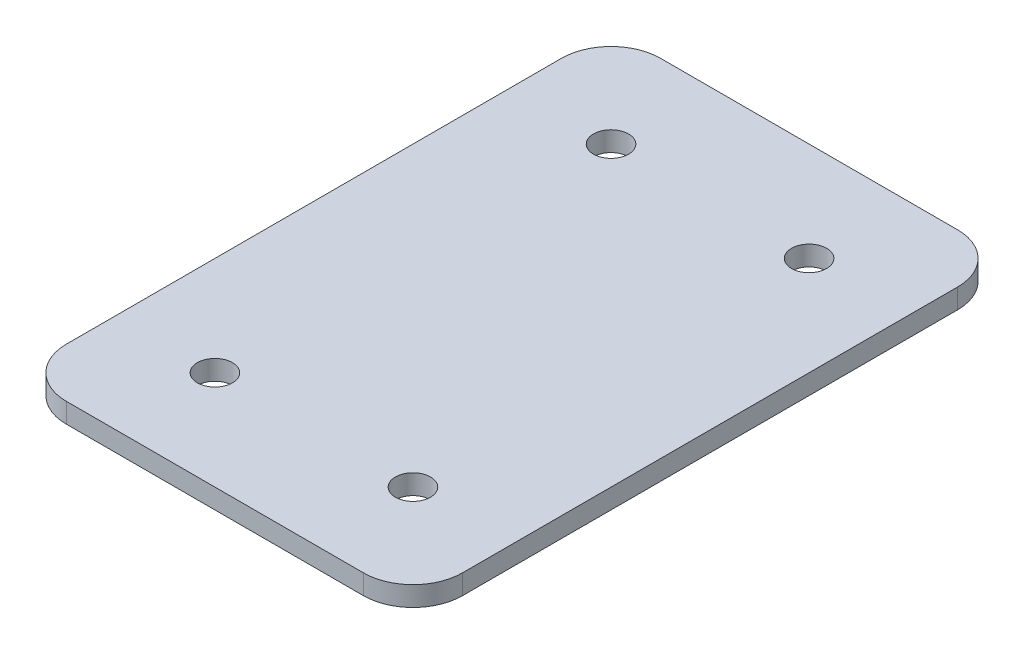
ISO-10303-21;
HEADER;
FILE_DESCRIPTION(('STEP AP214'),'2;1');
FILE_NAME('part.step','',(''),(''),'','','');
FILE_SCHEMA(('AUTOMOTIVE_DESIGN { 1 0 10303 214 1 1 1 1 }'));
ENDSEC;
DATA;
#1=APPLICATION_CONTEXT('core data for automotive mechanical design processes');
#2=APPLICATION_PROTOCOL_DEFINITION('international standard','automotive_design',2000,#1);
#3=PRODUCT_CONTEXT('',#1,'mechanical');
#4=PRODUCT('Part','Part','',(#3));
#5=PRODUCT_RELATED_PRODUCT_CATEGORY('part','',(#4));
#6=PRODUCT_DEFINITION_FORMATION('','',#4);
#7=PRODUCT_DEFINITION_CONTEXT('part definition',#1,'design');
#8=PRODUCT_DEFINITION('design','',#6,#7);
#9=PRODUCT_DEFINITION_SHAPE('','',#8);
#10=(LENGTH_UNIT() NAMED_UNIT(*) SI_UNIT(.MILLI.,.METRE.));
#11=(NAMED_UNIT(*) PLANE_ANGLE_UNIT() SI_UNIT($,.RADIAN.));
#12=(NAMED_UNIT(*) SI_UNIT($,.STERADIAN.) SOLID_ANGLE_UNIT());
#13=UNCERTAINTY_MEASURE_WITH_UNIT(LENGTH_MEASURE(1.E-05),#10,'distance_accuracy_value','');
#14=(GEOMETRIC_REPRESENTATION_CONTEXT(3) GLOBAL_UNCERTAINTY_ASSIGNED_CONTEXT((#13)) GLOBAL_UNIT_ASSIGNED_CONTEXT((#10,
#11,#12)) REPRESENTATION_CONTEXT('',''));
#15=CARTESIAN_POINT('',(0.,0.,0.));
#16=DIRECTION('',(0.,0.,1.));
#17=DIRECTION('',(1.,0.,0.));
#18=AXIS2_PLACEMENT_3D('',#15,#16,#17);
#19=CARTESIAN_POINT('',(50.8,2.54,0.));
#20=DIRECTION('',(-1.,0.,0.));
#21=DIRECTION('',(0.,0.,1.));
#22=AXIS2_PLACEMENT_3D('',#19,#20,#21);
#23=PLANE('',#22);
#24=DIRECTION('',(0.,0.,-1.));
#25=VECTOR('',#24,1.);
#26=CARTESIAN_POINT('',(50.8,0.,0.));
#27=LINE('',#26,#25);
#28=CARTESIAN_POINT('',(50.8,0.,-6.35000000000004));
#29=VERTEX_POINT('',#28);
#30=CARTESIAN_POINT('',(50.8,0.,-69.85));
#31=VERTEX_POINT('',#30);
#32=EDGE_CURVE('E150',#29,#31,#27,.T.);
#33=ORIENTED_EDGE('',*,*,#32,.T.);
#34=DIRECTION('',(0.,-1.,0.));
#35=VECTOR('',#34,1.);
#36=CARTESIAN_POINT('',(50.8,2.54,-69.85));
#37=LINE('',#36,#35);
#38=CARTESIAN_POINT('',(50.8,2.54,-69.85));
#39=VERTEX_POINT('',#38);
#40=EDGE_CURVE('E11',#39,#31,#37,.T.);
#41=ORIENTED_EDGE('',*,*,#40,.F.);
#42=DIRECTION('',(0.,0.,-1.));
#43=VECTOR('',#42,1.);
#44=CARTESIAN_POINT('',(50.8,2.54,0.));
#45=LINE('',#44,#43);
#46=CARTESIAN_POINT('',(50.8,2.54,-6.35000000000004));
#47=VERTEX_POINT('',#46);
#48=EDGE_CURVE('E95',#47,#39,#45,.T.);
#49=ORIENTED_EDGE('',*,*,#48,.F.);
#50=DIRECTION('',(0.,-1.,0.));
#51=VECTOR('',#50,1.);
#52=CARTESIAN_POINT('',(50.8,2.54,-6.35000000000004));
#53=LINE('',#52,#51);
#54=EDGE_CURVE('E146',#47,#29,#53,.T.);
#55=ORIENTED_EDGE('',*,*,#54,.T.);
#56=EDGE_LOOP('',(#33,#41,#49,#55));
#57=FACE_BOUND('',#56,.T.);
#58=ADVANCED_FACE('F39',(#57),#23,.F.);
#59=CARTESIAN_POINT('',(44.45,2.54,-69.85));
#60=DIRECTION('',(0.,-1.,0.));
#61=DIRECTION('',(0.,0.,-1.));
#62=AXIS2_PLACEMENT_3D('',#59,#60,#61);
#63=CYLINDRICAL_SURFACE('',#62,6.35);
#64=CARTESIAN_POINT('',(44.45,0.,-69.85));
#65=DIRECTION('',(0.,1.,0.));
#66=DIRECTION('',(0.,0.,1.));
#67=AXIS2_PLACEMENT_3D('',#64,#65,#66);
#68=CIRCLE('',#67,6.35);
#69=CARTESIAN_POINT('',(44.45,0.,-76.2));
#70=VERTEX_POINT('',#69);
#71=EDGE_CURVE('E153',#70,#31,#68,.F.);
#72=ORIENTED_EDGE('',*,*,#71,.F.);
#73=DIRECTION('',(0.,-1.,0.));
#74=VECTOR('',#73,1.);
#75=CARTESIAN_POINT('',(44.45,2.54,-76.2));
#76=LINE('',#75,#74);
#77=CARTESIAN_POINT('',(44.45,2.54,-76.2));
#78=VERTEX_POINT('',#77);
#79=EDGE_CURVE('E48',#78,#70,#76,.T.);
#80=ORIENTED_EDGE('',*,*,#79,.F.);
#81=CARTESIAN_POINT('',(44.45,2.54,-69.85));
#82=DIRECTION('',(0.,1.,0.));
#83=DIRECTION('',(0.,0.,1.));
#84=AXIS2_PLACEMENT_3D('',#81,#82,#83);
#85=CIRCLE('',#84,6.35);
#86=EDGE_CURVE('E203',#78,#39,#85,.F.);
#87=ORIENTED_EDGE('',*,*,#86,.T.);
#88=ORIENTED_EDGE('',*,*,#40,.T.);
#89=EDGE_LOOP('',(#72,#80,#87,#88));
#90=FACE_BOUND('',#89,.T.);
#91=ADVANCED_FACE('F193',(#90),#63,.T.);
#92=CARTESIAN_POINT('',(0.,2.54,-76.2));
#93=DIRECTION('',(0.,0.,-1.));
#94=DIRECTION('',(-1.,0.,0.));
#95=AXIS2_PLACEMENT_3D('',#92,#93,#94);
#96=PLANE('',#95);
#97=DIRECTION('',(1.,0.,0.));
#98=VECTOR('',#97,1.);
#99=CARTESIAN_POINT('',(0.,0.,-76.2));
#100=LINE('',#99,#98);
#101=CARTESIAN_POINT('',(6.35000000000004,0.,-76.2));
#102=VERTEX_POINT('',#101);
#103=EDGE_CURVE('E156',#102,#70,#100,.T.);
#104=ORIENTED_EDGE('',*,*,#103,.F.);
#105=DIRECTION('',(0.,-1.,0.));
#106=VECTOR('',#105,1.);
#107=CARTESIAN_POINT('',(6.35000000000004,2.54,-76.2));
#108=LINE('',#107,#106);
#109=CARTESIAN_POINT('',(6.35000000000004,2.54,-76.2));
#110=VERTEX_POINT('',#109);
#111=EDGE_CURVE('E183',#110,#102,#108,.T.);
#112=ORIENTED_EDGE('',*,*,#111,.F.);
#113=DIRECTION('',(1.,0.,0.));
#114=VECTOR('',#113,1.);
#115=CARTESIAN_POINT('',(0.,2.54,-76.2));
#116=LINE('',#115,#114);
#117=EDGE_CURVE('E190',#110,#78,#116,.T.);
#118=ORIENTED_EDGE('',*,*,#117,.T.);
#119=ORIENTED_EDGE('',*,*,#79,.T.);
#120=EDGE_LOOP('',(#104,#112,#118,#119));
#121=FACE_BOUND('',#120,.T.);
#122=ADVANCED_FACE('F188',(#121),#96,.T.);
#123=CARTESIAN_POINT('',(6.35,2.54,-69.85));
#124=DIRECTION('',(0.,-1.,0.));
#125=DIRECTION('',(0.,0.,-1.));
#126=AXIS2_PLACEMENT_3D('',#123,#124,#125);
#127=CYLINDRICAL_SURFACE('',#126,6.35);
#128=CARTESIAN_POINT('',(6.35,0.,-69.85));
#129=DIRECTION('',(0.,1.,0.));
#130=DIRECTION('',(0.,0.,1.));
#131=AXIS2_PLACEMENT_3D('',#128,#129,#130);
#132=CIRCLE('',#131,6.35);
#133=CARTESIAN_POINT('',(0.,0.,-69.85));
#134=VERTEX_POINT('',#133);
#135=EDGE_CURVE('E159',#134,#102,#132,.F.);
#136=ORIENTED_EDGE('',*,*,#135,.F.);
#137=DIRECTION('',(0.,-1.,0.));
#138=VECTOR('',#137,1.);
#139=CARTESIAN_POINT('',(0.,2.54,-69.85));
#140=LINE('',#139,#138);
#141=CARTESIAN_POINT('',(0.,2.54,-69.85));
#142=VERTEX_POINT('',#141);
#143=EDGE_CURVE('E181',#142,#134,#140,.T.);
#144=ORIENTED_EDGE('',*,*,#143,.F.);
#145=CARTESIAN_POINT('',(6.35,2.54,-69.85));
#146=DIRECTION('',(0.,1.,0.));
#147=DIRECTION('',(0.,0.,1.));
#148=AXIS2_PLACEMENT_3D('',#145,#146,#147);
#149=CIRCLE('',#148,6.35);
#150=EDGE_CURVE('E132',#142,#110,#149,.F.);
#151=ORIENTED_EDGE('',*,*,#150,.T.);
#152=ORIENTED_EDGE('',*,*,#111,.T.);
#153=EDGE_LOOP('',(#136,#144,#151,#152));
#154=FACE_BOUND('',#153,.T.);
#155=ADVANCED_FACE('F201',(#154),#127,.T.);
#156=CARTESIAN_POINT('',(0.,2.54,0.));
#157=DIRECTION('',(-1.,0.,0.));
#158=DIRECTION('',(0.,0.,1.));
#159=AXIS2_PLACEMENT_3D('',#156,#157,#158);
#160=PLANE('',#159);
#161=DIRECTION('',(0.,0.,-1.));
#162=VECTOR('',#161,1.);
#163=CARTESIAN_POINT('',(0.,0.,0.));
#164=LINE('',#163,#162);
#165=CARTESIAN_POINT('',(0.,0.,-6.35000000000004));
#166=VERTEX_POINT('',#165);
#167=EDGE_CURVE('E162',#166,#134,#164,.T.);
#168=ORIENTED_EDGE('',*,*,#167,.F.);
#169=DIRECTION('',(0.,-1.,0.));
#170=VECTOR('',#169,1.);
#171=CARTESIAN_POINT('',(0.,2.54,-6.35000000000004));
#172=LINE('',#171,#170);
#173=CARTESIAN_POINT('',(0.,2.54,-6.35000000000004));
#174=VERTEX_POINT('',#173);
#175=EDGE_CURVE('E119',#174,#166,#172,.T.);
#176=ORIENTED_EDGE('',*,*,#175,.F.);
#177=DIRECTION('',(0.,0.,-1.));
#178=VECTOR('',#177,1.);
#179=CARTESIAN_POINT('',(0.,2.54,0.));
#180=LINE('',#179,#178);
#181=EDGE_CURVE('E130',#174,#142,#180,.T.);
#182=ORIENTED_EDGE('',*,*,#181,.T.);
#183=ORIENTED_EDGE('',*,*,#143,.T.);
#184=EDGE_LOOP('',(#168,#176,#182,#183));
#185=FACE_BOUND('',#184,.T.);
#186=ADVANCED_FACE('F235',(#185),#160,.T.);
#187=CARTESIAN_POINT('',(6.35,2.54,-6.35));
#188=DIRECTION('',(0.,-1.,0.));
#189=DIRECTION('',(0.,0.,-1.));
#190=AXIS2_PLACEMENT_3D('',#187,#188,#189);
#191=CYLINDRICAL_SURFACE('',#190,6.35);
#192=CARTESIAN_POINT('',(6.35,0.,-6.35));
#193=DIRECTION('',(0.,1.,0.));
#194=DIRECTION('',(0.,0.,1.));
#195=AXIS2_PLACEMENT_3D('',#192,#193,#194);
#196=CIRCLE('',#195,6.35);
#197=CARTESIAN_POINT('',(6.35000000000004,0.,0.));
#198=VERTEX_POINT('',#197);
#199=EDGE_CURVE('E118',#198,#166,#196,.F.);
#200=ORIENTED_EDGE('',*,*,#199,.F.);
#201=DIRECTION('',(0.,-1.,0.));
#202=VECTOR('',#201,1.);
#203=CARTESIAN_POINT('',(6.35000000000004,2.54,0.));
#204=LINE('',#203,#202);
#205=CARTESIAN_POINT('',(6.35000000000004,2.54,0.));
#206=VERTEX_POINT('',#205);
#207=EDGE_CURVE('E112',#206,#198,#204,.T.);
#208=ORIENTED_EDGE('',*,*,#207,.F.);
#209=CARTESIAN_POINT('',(6.35,2.54,-6.35));
#210=DIRECTION('',(0.,1.,0.));
#211=DIRECTION('',(0.,0.,1.));
#212=AXIS2_PLACEMENT_3D('',#209,#210,#211);
#213=CIRCLE('',#212,6.35);
#214=EDGE_CURVE('E116',#206,#174,#213,.F.);
#215=ORIENTED_EDGE('',*,*,#214,.T.);
#216=ORIENTED_EDGE('',*,*,#175,.T.);
#217=EDGE_LOOP('',(#200,#208,#215,#216));
#218=FACE_BOUND('',#217,.T.);
#219=ADVANCED_FACE('F114',(#218),#191,.T.);
#220=CARTESIAN_POINT('',(0.,2.54,0.));
#221=DIRECTION('',(0.,0.,-1.));
#222=DIRECTION('',(-1.,0.,0.));
#223=AXIS2_PLACEMENT_3D('',#220,#221,#222);
#224=PLANE('',#223);
#225=DIRECTION('',(1.,0.,0.));
#226=VECTOR('',#225,1.);
#227=CARTESIAN_POINT('',(0.,0.,0.));
#228=LINE('',#227,#226);
#229=CARTESIAN_POINT('',(44.45,0.,0.));
#230=VERTEX_POINT('',#229);
#231=EDGE_CURVE('E83',#198,#230,#228,.T.);
#232=ORIENTED_EDGE('',*,*,#231,.T.);
#233=DIRECTION('',(0.,-1.,0.));
#234=VECTOR('',#233,1.);
#235=CARTESIAN_POINT('',(44.45,2.54,0.));
#236=LINE('',#235,#234);
#237=CARTESIAN_POINT('',(44.45,2.54,0.));
#238=VERTEX_POINT('',#237);
#239=EDGE_CURVE('E120',#238,#230,#236,.T.);
#240=ORIENTED_EDGE('',*,*,#239,.F.);
#241=DIRECTION('',(1.,0.,0.));
#242=VECTOR('',#241,1.);
#243=CARTESIAN_POINT('',(0.,2.54,0.));
#244=LINE('',#243,#242);
#245=EDGE_CURVE('E122',#206,#238,#244,.T.);
#246=ORIENTED_EDGE('',*,*,#245,.F.);
#247=ORIENTED_EDGE('',*,*,#207,.T.);
#248=EDGE_LOOP('',(#232,#240,#246,#247));
#249=FACE_BOUND('',#248,.T.);
#250=ADVANCED_FACE('F123',(#249),#224,.F.);
#251=CARTESIAN_POINT('',(38.1,2.54,-63.5));
#252=DIRECTION('',(0.,-1.,0.));
#253=DIRECTION('',(0.,0.,-1.));
#254=AXIS2_PLACEMENT_3D('',#251,#252,#253);
#255=CYLINDRICAL_SURFACE('',#254,2.25);
#256=CARTESIAN_POINT('',(38.1,2.54,-63.5));
#257=DIRECTION('',(0.,1.,0.));
#258=DIRECTION('',(0.,0.,1.));
#259=AXIS2_PLACEMENT_3D('',#256,#257,#258);
#260=CIRCLE('',#259,2.25);
#261=CARTESIAN_POINT('',(38.1,2.54,-61.25));
#262=VERTEX_POINT('',#261);
#263=EDGE_CURVE('E140',#262,#262,#260,.F.);
#264=ORIENTED_EDGE('',*,*,#263,.F.);
#265=EDGE_LOOP('',(#264));
#266=FACE_BOUND('',#265,.T.);
#267=CARTESIAN_POINT('',(38.1,0.,-63.5));
#268=DIRECTION('',(0.,1.,0.));
#269=DIRECTION('',(0.,0.,1.));
#270=AXIS2_PLACEMENT_3D('',#267,#268,#269);
#271=CIRCLE('',#270,2.25);
#272=CARTESIAN_POINT('',(38.1,0.,-61.25));
#273=VERTEX_POINT('',#272);
#274=EDGE_CURVE('E171',#273,#273,#271,.F.);
#275=ORIENTED_EDGE('',*,*,#274,.T.);
#276=EDGE_LOOP('',(#275));
#277=FACE_BOUND('',#276,.T.);
#278=ADVANCED_FACE('F243',(#266,#277),#255,.F.);
#279=CARTESIAN_POINT('',(12.7,2.54,-12.7));
#280=DIRECTION('',(0.,-1.,0.));
#281=DIRECTION('',(0.,0.,-1.));
#282=AXIS2_PLACEMENT_3D('',#279,#280,#281);
#283=CYLINDRICAL_SURFACE('',#282,2.25);
#284=CARTESIAN_POINT('',(12.7,2.54,-12.7));
#285=DIRECTION('',(0.,1.,0.));
#286=DIRECTION('',(0.,0.,1.));
#287=AXIS2_PLACEMENT_3D('',#284,#285,#286);
#288=CIRCLE('',#287,2.25);
#289=CARTESIAN_POINT('',(12.7,2.54,-10.45));
#290=VERTEX_POINT('',#289);
#291=EDGE_CURVE('E137',#290,#290,#288,.F.);
#292=ORIENTED_EDGE('',*,*,#291,.F.);
#293=EDGE_LOOP('',(#292));
#294=FACE_BOUND('',#293,.T.);
#295=CARTESIAN_POINT('',(12.7,0.,-12.7));
#296=DIRECTION('',(0.,1.,0.));
#297=DIRECTION('',(0.,0.,1.));
#298=AXIS2_PLACEMENT_3D('',#295,#296,#297);
#299=CIRCLE('',#298,2.25);
#300=CARTESIAN_POINT('',(12.7,0.,-10.45));
#301=VERTEX_POINT('',#300);
#302=EDGE_CURVE('E168',#301,#301,#299,.F.);
#303=ORIENTED_EDGE('',*,*,#302,.T.);
#304=EDGE_LOOP('',(#303));
#305=FACE_BOUND('',#304,.T.);
#306=ADVANCED_FACE('F247',(#294,#305),#283,.F.);
#307=CARTESIAN_POINT('',(44.45,2.54,-6.35));
#308=DIRECTION('',(0.,-1.,0.));
#309=DIRECTION('',(0.,0.,-1.));
#310=AXIS2_PLACEMENT_3D('',#307,#308,#309);
#311=CYLINDRICAL_SURFACE('',#310,6.35);
#312=CARTESIAN_POINT('',(44.45,0.,-6.35));
#313=DIRECTION('',(0.,1.,0.));
#314=DIRECTION('',(0.,0.,1.));
#315=AXIS2_PLACEMENT_3D('',#312,#313,#314);
#316=CIRCLE('',#315,6.35);
#317=EDGE_CURVE('E89',#230,#29,#316,.T.);
#318=ORIENTED_EDGE('',*,*,#317,.T.);
#319=ORIENTED_EDGE('',*,*,#54,.F.);
#320=CARTESIAN_POINT('',(44.45,2.54,-6.35));
#321=DIRECTION('',(0.,1.,0.));
#322=DIRECTION('',(0.,0.,1.));
#323=AXIS2_PLACEMENT_3D('',#320,#321,#322);
#324=CIRCLE('',#323,6.35);
#325=EDGE_CURVE('E56',#238,#47,#324,.T.);
#326=ORIENTED_EDGE('',*,*,#325,.F.);
#327=ORIENTED_EDGE('',*,*,#239,.T.);
#328=EDGE_LOOP('',(#318,#319,#326,#327));
#329=FACE_BOUND('',#328,.T.);
#330=ADVANCED_FACE('F244',(#329),#311,.T.);
#331=CARTESIAN_POINT('',(38.1,2.54,-12.7));
#332=DIRECTION('',(0.,-1.,0.));
#333=DIRECTION('',(0.,0.,-1.));
#334=AXIS2_PLACEMENT_3D('',#331,#332,#333);
#335=CYLINDRICAL_SURFACE('',#334,2.25);
#336=CARTESIAN_POINT('',(38.1,2.54,-12.7));
#337=DIRECTION('',(0.,1.,0.));
#338=DIRECTION('',(0.,0.,1.));
#339=AXIS2_PLACEMENT_3D('',#336,#337,#338);
#340=CIRCLE('',#339,2.25);
#341=CARTESIAN_POINT('',(38.1,2.54,-10.45));
#342=VERTEX_POINT('',#341);
#343=EDGE_CURVE('E177',#342,#342,#340,.T.);
#344=ORIENTED_EDGE('',*,*,#343,.T.);
#345=EDGE_LOOP('',(#344));
#346=FACE_BOUND('',#345,.T.);
#347=CARTESIAN_POINT('',(38.1,0.,-12.7));
#348=DIRECTION('',(0.,1.,0.));
#349=DIRECTION('',(0.,0.,1.));
#350=AXIS2_PLACEMENT_3D('',#347,#348,#349);
#351=CIRCLE('',#350,2.25);
#352=CARTESIAN_POINT('',(38.1,0.,-10.45));
#353=VERTEX_POINT('',#352);
#354=EDGE_CURVE('E147',#353,#353,#351,.T.);
#355=ORIENTED_EDGE('',*,*,#354,.F.);
#356=EDGE_LOOP('',(#355));
#357=FACE_BOUND('',#356,.T.);
#358=ADVANCED_FACE('F41',(#346,#357),#335,.F.);
#359=CARTESIAN_POINT('',(12.7,2.54,-63.5));
#360=DIRECTION('',(0.,-1.,0.));
#361=DIRECTION('',(0.,0.,-1.));
#362=AXIS2_PLACEMENT_3D('',#359,#360,#361);
#363=CYLINDRICAL_SURFACE('',#362,2.25);
#364=CARTESIAN_POINT('',(12.7,2.54,-63.5));
#365=DIRECTION('',(0.,1.,0.));
#366=DIRECTION('',(0.,0.,1.));
#367=AXIS2_PLACEMENT_3D('',#364,#365,#366);
#368=CIRCLE('',#367,2.25);
#369=CARTESIAN_POINT('',(12.7,2.54,-61.25));
#370=VERTEX_POINT('',#369);
#371=EDGE_CURVE('E143',#370,#370,#368,.T.);
#372=ORIENTED_EDGE('',*,*,#371,.T.);
#373=EDGE_LOOP('',(#372));
#374=FACE_BOUND('',#373,.T.);
#375=CARTESIAN_POINT('',(12.7,0.,-63.5));
#376=DIRECTION('',(0.,1.,0.));
#377=DIRECTION('',(0.,0.,1.));
#378=AXIS2_PLACEMENT_3D('',#375,#376,#377);
#379=CIRCLE('',#378,2.25);
#380=CARTESIAN_POINT('',(12.7,0.,-61.25));
#381=VERTEX_POINT('',#380);
#382=EDGE_CURVE('E174',#381,#381,#379,.T.);
#383=ORIENTED_EDGE('',*,*,#382,.F.);
#384=EDGE_LOOP('',(#383));
#385=FACE_BOUND('',#384,.T.);
#386=ADVANCED_FACE('F214',(#374,#385),#363,.F.);
#387=CARTESIAN_POINT('',(0.,2.54,0.));
#388=DIRECTION('',(0.,1.,0.));
#389=DIRECTION('',(0.,0.,1.));
#390=AXIS2_PLACEMENT_3D('',#387,#388,#389);
#391=PLANE('',#390);
#392=ORIENTED_EDGE('',*,*,#343,.F.);
#393=EDGE_LOOP('',(#392));
#394=FACE_BOUND('',#393,.T.);
#395=ORIENTED_EDGE('',*,*,#48,.T.);
#396=ORIENTED_EDGE('',*,*,#86,.F.);
#397=ORIENTED_EDGE('',*,*,#117,.F.);
#398=ORIENTED_EDGE('',*,*,#150,.F.);
#399=ORIENTED_EDGE('',*,*,#181,.F.);
#400=ORIENTED_EDGE('',*,*,#214,.F.);
#401=ORIENTED_EDGE('',*,*,#245,.T.);
#402=ORIENTED_EDGE('',*,*,#325,.T.);
#403=EDGE_LOOP('',(#395,#396,#397,#398,#399,#400,#401,#402));
#404=FACE_BOUND('',#403,.T.);
#405=ORIENTED_EDGE('',*,*,#291,.T.);
#406=EDGE_LOOP('',(#405));
#407=FACE_BOUND('',#406,.T.);
#408=ORIENTED_EDGE('',*,*,#263,.T.);
#409=EDGE_LOOP('',(#408));
#410=FACE_BOUND('',#409,.T.);
#411=ORIENTED_EDGE('',*,*,#371,.F.);
#412=EDGE_LOOP('',(#411));
#413=FACE_BOUND('',#412,.T.);
#414=ADVANCED_FACE('F126',(#394,#404,#407,#410,#413),#391,.T.);
#415=CARTESIAN_POINT('',(0.,0.,0.));
#416=DIRECTION('',(0.,1.,0.));
#417=DIRECTION('',(0.,0.,1.));
#418=AXIS2_PLACEMENT_3D('',#415,#416,#417);
#419=PLANE('',#418);
#420=ORIENTED_EDGE('',*,*,#354,.T.);
#421=EDGE_LOOP('',(#420));
#422=FACE_BOUND('',#421,.T.);
#423=ORIENTED_EDGE('',*,*,#32,.F.);
#424=ORIENTED_EDGE('',*,*,#317,.F.);
#425=ORIENTED_EDGE('',*,*,#231,.F.);
#426=ORIENTED_EDGE('',*,*,#199,.T.);
#427=ORIENTED_EDGE('',*,*,#167,.T.);
#428=ORIENTED_EDGE('',*,*,#135,.T.);
#429=ORIENTED_EDGE('',*,*,#103,.T.);
#430=ORIENTED_EDGE('',*,*,#71,.T.);
#431=EDGE_LOOP('',(#423,#424,#425,#426,#427,#428,#429,#430));
#432=FACE_BOUND('',#431,.T.);
#433=ORIENTED_EDGE('',*,*,#302,.F.);
#434=EDGE_LOOP('',(#433));
#435=FACE_BOUND('',#434,.T.);
#436=ORIENTED_EDGE('',*,*,#274,.F.);
#437=EDGE_LOOP('',(#436));
#438=FACE_BOUND('',#437,.T.);
#439=ORIENTED_EDGE('',*,*,#382,.T.);
#440=EDGE_LOOP('',(#439));
#441=FACE_BOUND('',#440,.T.);
#442=ADVANCED_FACE('F196',(#422,#432,#435,#438,#441),#419,.F.);
#443=CLOSED_SHELL('',(#58,#91,#122,#155,#186,#219,#250,#278,#306,#330,#358,#386,#414,#442));
#444=MANIFOLD_SOLID_BREP('B2',#443);
#445=ADVANCED_BREP_SHAPE_REPRESENTATION('',(#18,#444),#14);
#446=SHAPE_DEFINITION_REPRESENTATION(#9,#445);
ENDSEC;
END-ISO-10303-21;
